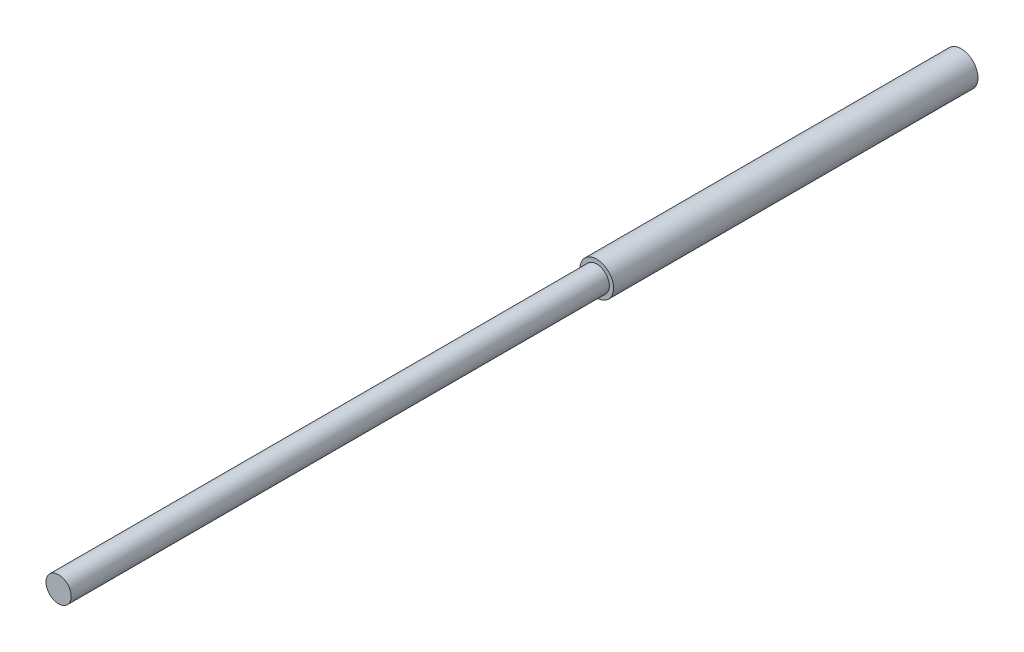
ISO-10303-21;
HEADER;
FILE_DESCRIPTION(('STEP AP214'),'2;1');
FILE_NAME('part.step','',(''),(''),'','','');
FILE_SCHEMA(('AUTOMOTIVE_DESIGN { 1 0 10303 214 1 1 1 1 }'));
ENDSEC;
DATA;
#1=APPLICATION_CONTEXT('core data for automotive mechanical design processes');
#2=APPLICATION_PROTOCOL_DEFINITION('international standard','automotive_design',2000,#1);
#3=PRODUCT_CONTEXT('',#1,'mechanical');
#4=PRODUCT('Part','Part','',(#3));
#5=PRODUCT_RELATED_PRODUCT_CATEGORY('part','',(#4));
#6=PRODUCT_DEFINITION_FORMATION('','',#4);
#7=PRODUCT_DEFINITION_CONTEXT('part definition',#1,'design');
#8=PRODUCT_DEFINITION('design','',#6,#7);
#9=PRODUCT_DEFINITION_SHAPE('','',#8);
#10=(LENGTH_UNIT() NAMED_UNIT(*) SI_UNIT(.MILLI.,.METRE.));
#11=(NAMED_UNIT(*) PLANE_ANGLE_UNIT() SI_UNIT($,.RADIAN.));
#12=(NAMED_UNIT(*) SI_UNIT($,.STERADIAN.) SOLID_ANGLE_UNIT());
#13=UNCERTAINTY_MEASURE_WITH_UNIT(LENGTH_MEASURE(1.E-05),#10,'distance_accuracy_value','');
#14=(GEOMETRIC_REPRESENTATION_CONTEXT(3) GLOBAL_UNCERTAINTY_ASSIGNED_CONTEXT((#13)) GLOBAL_UNIT_ASSIGNED_CONTEXT((#10,
#11,#12)) REPRESENTATION_CONTEXT('',''));
#15=CARTESIAN_POINT('',(0.,0.,0.));
#16=DIRECTION('',(0.,0.,1.));
#17=DIRECTION('',(1.,0.,0.));
#18=AXIS2_PLACEMENT_3D('',#15,#16,#17);
#19=CARTESIAN_POINT('',(0.,0.,108.36));
#20=DIRECTION('',(0.,0.,-1.));
#21=DIRECTION('',(-1.,0.,0.));
#22=AXIS2_PLACEMENT_3D('',#19,#20,#21);
#23=CYLINDRICAL_SURFACE('',#22,5.);
#24=CARTESIAN_POINT('',(0.,0.,108.36));
#25=DIRECTION('',(0.,0.,1.));
#26=DIRECTION('',(1.,0.,0.));
#27=AXIS2_PLACEMENT_3D('',#24,#25,#26);
#28=CIRCLE('',#27,5.);
#29=CARTESIAN_POINT('',(5.,0.,108.36));
#30=VERTEX_POINT('',#29);
#31=EDGE_CURVE('E49',#30,#30,#28,.T.);
#32=ORIENTED_EDGE('',*,*,#31,.F.);
#33=EDGE_LOOP('',(#32));
#34=FACE_BOUND('',#33,.T.);
#35=CARTESIAN_POINT('',(0.,0.,0.));
#36=DIRECTION('',(0.,0.,1.));
#37=DIRECTION('',(1.,0.,0.));
#38=AXIS2_PLACEMENT_3D('',#35,#36,#37);
#39=CIRCLE('',#38,5.);
#40=CARTESIAN_POINT('',(5.,0.,0.));
#41=VERTEX_POINT('',#40);
#42=EDGE_CURVE('E44',#41,#41,#39,.T.);
#43=ORIENTED_EDGE('',*,*,#42,.T.);
#44=EDGE_LOOP('',(#43));
#45=FACE_BOUND('',#44,.T.);
#46=ADVANCED_FACE('F41',(#34,#45),#23,.T.);
#47=CARTESIAN_POINT('',(0.,0.,108.36));
#48=DIRECTION('',(0.,0.,1.));
#49=DIRECTION('',(1.,0.,0.));
#50=AXIS2_PLACEMENT_3D('',#47,#48,#49);
#51=PLANE('',#50);
#52=CARTESIAN_POINT('',(0.,0.,108.36));
#53=DIRECTION('',(0.,0.,1.));
#54=DIRECTION('',(1.,0.,0.));
#55=AXIS2_PLACEMENT_3D('',#52,#53,#54);
#56=CIRCLE('',#55,3.75);
#57=CARTESIAN_POINT('',(3.75,0.,108.36));
#58=VERTEX_POINT('',#57);
#59=EDGE_CURVE('E10',#58,#58,#56,.T.);
#60=ORIENTED_EDGE('',*,*,#59,.F.);
#61=EDGE_LOOP('',(#60));
#62=FACE_BOUND('',#61,.T.);
#63=ORIENTED_EDGE('',*,*,#31,.T.);
#64=EDGE_LOOP('',(#63));
#65=FACE_BOUND('',#64,.T.);
#66=ADVANCED_FACE('F69',(#62,#65),#51,.T.);
#67=CARTESIAN_POINT('',(0.,0.,0.));
#68=DIRECTION('',(0.,0.,1.));
#69=DIRECTION('',(1.,0.,0.));
#70=AXIS2_PLACEMENT_3D('',#67,#68,#69);
#71=PLANE('',#70);
#72=ORIENTED_EDGE('',*,*,#42,.F.);
#73=EDGE_LOOP('',(#72));
#74=FACE_BOUND('',#73,.T.);
#75=ADVANCED_FACE('F66',(#74),#71,.F.);
#76=CARTESIAN_POINT('',(0.,0.,268.36));
#77=DIRECTION('',(0.,0.,-1.));
#78=DIRECTION('',(-1.,0.,0.));
#79=AXIS2_PLACEMENT_3D('',#76,#77,#78);
#80=CYLINDRICAL_SURFACE('',#79,3.75);
#81=CARTESIAN_POINT('',(0.,0.,268.36));
#82=DIRECTION('',(0.,0.,1.));
#83=DIRECTION('',(1.,0.,0.));
#84=AXIS2_PLACEMENT_3D('',#81,#82,#83);
#85=CIRCLE('',#84,3.75);
#86=CARTESIAN_POINT('',(3.75,0.,268.36));
#87=VERTEX_POINT('',#86);
#88=EDGE_CURVE('E56',#87,#87,#85,.T.);
#89=ORIENTED_EDGE('',*,*,#88,.F.);
#90=EDGE_LOOP('',(#89));
#91=FACE_BOUND('',#90,.T.);
#92=ORIENTED_EDGE('',*,*,#59,.T.);
#93=EDGE_LOOP('',(#92));
#94=FACE_BOUND('',#93,.T.);
#95=ADVANCED_FACE('F68',(#91,#94),#80,.T.);
#96=CARTESIAN_POINT('',(0.,0.,268.36));
#97=DIRECTION('',(0.,0.,1.));
#98=DIRECTION('',(1.,0.,0.));
#99=AXIS2_PLACEMENT_3D('',#96,#97,#98);
#100=PLANE('',#99);
#101=ORIENTED_EDGE('',*,*,#88,.T.);
#102=EDGE_LOOP('',(#101));
#103=FACE_BOUND('',#102,.T.);
#104=ADVANCED_FACE('F74',(#103),#100,.T.);
#105=CLOSED_SHELL('',(#46,#66,#75,#95,#104));
#106=MANIFOLD_SOLID_BREP('B2',#105);
#107=ADVANCED_BREP_SHAPE_REPRESENTATION('',(#18,#106),#14);
#108=SHAPE_DEFINITION_REPRESENTATION(#9,#107);
ENDSEC;
END-ISO-10303-21;
